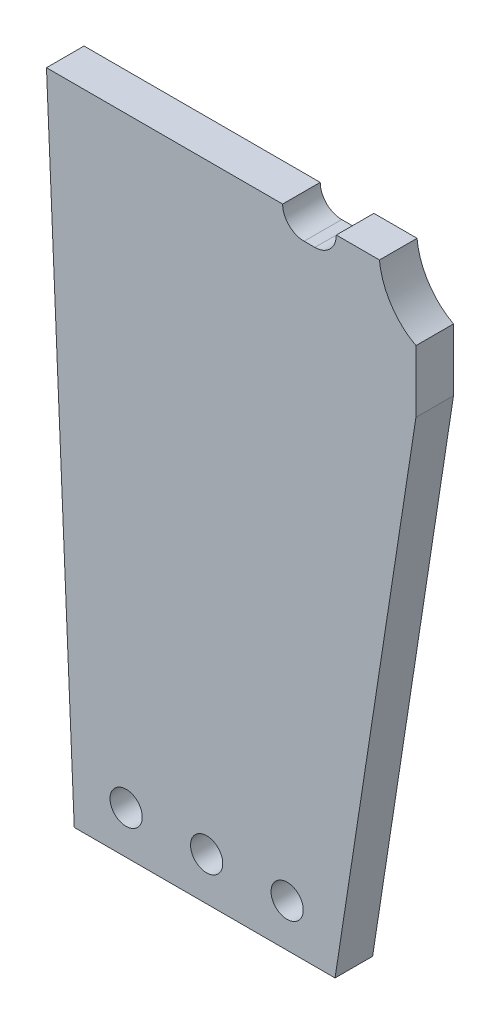
ISO-10303-21;
HEADER;
FILE_DESCRIPTION(('STEP AP214'),'2;1');
FILE_NAME('part.step','',(''),(''),'','','');
FILE_SCHEMA(('AUTOMOTIVE_DESIGN { 1 0 10303 214 1 1 1 1 }'));
ENDSEC;
DATA;
#1=APPLICATION_CONTEXT('core data for automotive mechanical design processes');
#2=APPLICATION_PROTOCOL_DEFINITION('international standard','automotive_design',2000,#1);
#3=PRODUCT_CONTEXT('',#1,'mechanical');
#4=PRODUCT('Part','Part','',(#3));
#5=PRODUCT_RELATED_PRODUCT_CATEGORY('part','',(#4));
#6=PRODUCT_DEFINITION_FORMATION('','',#4);
#7=PRODUCT_DEFINITION_CONTEXT('part definition',#1,'design');
#8=PRODUCT_DEFINITION('design','',#6,#7);
#9=PRODUCT_DEFINITION_SHAPE('','',#8);
#10=(LENGTH_UNIT() NAMED_UNIT(*) SI_UNIT(.MILLI.,.METRE.));
#11=(NAMED_UNIT(*) PLANE_ANGLE_UNIT() SI_UNIT($,.RADIAN.));
#12=(NAMED_UNIT(*) SI_UNIT($,.STERADIAN.) SOLID_ANGLE_UNIT());
#13=UNCERTAINTY_MEASURE_WITH_UNIT(LENGTH_MEASURE(1.E-05),#10,'distance_accuracy_value','');
#14=(GEOMETRIC_REPRESENTATION_CONTEXT(3) GLOBAL_UNCERTAINTY_ASSIGNED_CONTEXT((#13)) GLOBAL_UNIT_ASSIGNED_CONTEXT((#10,
#11,#12)) REPRESENTATION_CONTEXT('',''));
#15=CARTESIAN_POINT('',(0.,0.,0.));
#16=DIRECTION('',(0.,0.,1.));
#17=DIRECTION('',(1.,0.,0.));
#18=AXIS2_PLACEMENT_3D('',#15,#16,#17);
#19=CARTESIAN_POINT('',(46.8388847107798,0.,7.));
#20=DIRECTION('',(-1.,0.,0.));
#21=DIRECTION('',(0.,0.,1.));
#22=AXIS2_PLACEMENT_3D('',#19,#20,#21);
#23=PLANE('',#22);
#24=DIRECTION('',(0.,1.,0.));
#25=VECTOR('',#24,1.);
#26=CARTESIAN_POINT('',(46.8388847107798,0.,0.));
#27=LINE('',#26,#25);
#28=CARTESIAN_POINT('',(46.8388847107798,-72.0000000000028,0.));
#29=VERTEX_POINT('',#28);
#30=CARTESIAN_POINT('',(46.8388847107798,-60.421650597591,0.));
#31=VERTEX_POINT('',#30);
#32=EDGE_CURVE('E148',#29,#31,#27,.T.);
#33=ORIENTED_EDGE('',*,*,#32,.T.);
#34=DIRECTION('',(0.,0.,-1.));
#35=VECTOR('',#34,1.);
#36=CARTESIAN_POINT('',(46.8388847107798,-60.421650597591,7.));
#37=LINE('',#36,#35);
#38=CARTESIAN_POINT('',(46.8388847107798,-60.421650597591,7.));
#39=VERTEX_POINT('',#38);
#40=EDGE_CURVE('E42',#39,#31,#37,.T.);
#41=ORIENTED_EDGE('',*,*,#40,.F.);
#42=DIRECTION('',(0.,1.,0.));
#43=VECTOR('',#42,1.);
#44=CARTESIAN_POINT('',(46.8388847107798,0.,7.));
#45=LINE('',#44,#43);
#46=CARTESIAN_POINT('',(46.8388847107798,-72.0000000000028,7.));
#47=VERTEX_POINT('',#46);
#48=EDGE_CURVE('E175',#47,#39,#45,.T.);
#49=ORIENTED_EDGE('',*,*,#48,.F.);
#50=DIRECTION('',(0.,0.,-1.));
#51=VECTOR('',#50,1.);
#52=CARTESIAN_POINT('',(46.8388847107798,-72.0000000000028,7.));
#53=LINE('',#52,#51);
#54=EDGE_CURVE('E147',#47,#29,#53,.T.);
#55=ORIENTED_EDGE('',*,*,#54,.T.);
#56=EDGE_LOOP('',(#33,#41,#49,#55));
#57=FACE_BOUND('',#56,.T.);
#58=ADVANCED_FACE('F35',(#57),#23,.F.);
#59=CARTESIAN_POINT('',(46.8388847107809,-60.4216505962603,7.));
#60=CARTESIAN_POINT('',(42.9828321644224,-58.3958346056191,7.));
#61=CARTESIAN_POINT('',(38.906182162935,-51.8713110265102,7.));
#62=CARTESIAN_POINT('',(41.1386014831777,-41.6329969853445,7.));
#63=CARTESIAN_POINT('',(45.1889963757844,-37.4610602613759,7.));
#64=CARTESIAN_POINT('',(46.8388847133775,-34.5209470708188,7.));
#65=B_SPLINE_CURVE_WITH_KNOTS('',3,(#59,#60,#61,#62,#63,#64),.UNSPECIFIED.,.F.,.F.,(4,1,1,4),
(0.,0.43493140060886,0.661677592224686,0.998582109425411),.UNSPECIFIED.);
#66=DIRECTION('',(0.,0.,-1.));
#67=VECTOR('',#66,1.);
#68=SURFACE_OF_LINEAR_EXTRUSION('',#65,#67);
#69=CARTESIAN_POINT('',(46.8388847107809,-60.4216505962603,0.));
#70=CARTESIAN_POINT('',(42.9828321644224,-58.3958346056191,0.));
#71=CARTESIAN_POINT('',(38.906182162935,-51.8713110265102,0.));
#72=CARTESIAN_POINT('',(41.1386014831777,-41.6329969853445,0.));
#73=CARTESIAN_POINT('',(45.1889963757844,-37.4610602613759,0.));
#74=CARTESIAN_POINT('',(46.8388847133775,-34.5209470708188,0.));
#75=B_SPLINE_CURVE_WITH_KNOTS('',3,(#69,#70,#71,#72,#73,#74),.UNSPECIFIED.,.F.,.F.,(4,1,1,4),
(0.,0.43493140060886,0.661677592224686,0.998582109425411),.UNSPECIFIED.);
#76=CARTESIAN_POINT('',(40.0462321294866,-50.0000000000019,0.));
#77=VERTEX_POINT('',#76);
#78=EDGE_CURVE('E151',#31,#77,#75,.T.);
#79=ORIENTED_EDGE('',*,*,#78,.T.);
#80=DIRECTION('',(0.,0.,-1.));
#81=VECTOR('',#80,1.);
#82=CARTESIAN_POINT('',(40.0462321294866,-50.0000000000019,7.));
#83=LINE('',#82,#81);
#84=CARTESIAN_POINT('',(40.0462321294866,-50.0000000000019,7.));
#85=VERTEX_POINT('',#84);
#86=EDGE_CURVE('E183',#85,#77,#83,.T.);
#87=ORIENTED_EDGE('',*,*,#86,.F.);
#88=EDGE_CURVE('E100',#39,#85,#65,.T.);
#89=ORIENTED_EDGE('',*,*,#88,.F.);
#90=ORIENTED_EDGE('',*,*,#40,.T.);
#91=EDGE_LOOP('',(#79,#87,#89,#90));
#92=FACE_BOUND('',#91,.T.);
#93=ADVANCED_FACE('F185',(#92),#68,.F.);
#94=CARTESIAN_POINT('',(0.,-50.0000000000018,7.));
#95=DIRECTION('',(0.,1.,0.));
#96=DIRECTION('',(-1.,0.,0.));
#97=AXIS2_PLACEMENT_3D('',#94,#95,#96);
#98=PLANE('',#97);
#99=DIRECTION('',(1.,0.,0.));
#100=VECTOR('',#99,1.);
#101=CARTESIAN_POINT('',(0.,-50.0000000000018,0.));
#102=LINE('',#101,#100);
#103=CARTESIAN_POINT('',(32.,-50.0000000000019,0.));
#104=VERTEX_POINT('',#103);
#105=EDGE_CURVE('E156',#104,#77,#102,.T.);
#106=ORIENTED_EDGE('',*,*,#105,.F.);
#107=DIRECTION('',(0.,0.,-1.));
#108=VECTOR('',#107,1.);
#109=CARTESIAN_POINT('',(32.,-50.0000000000019,7.));
#110=LINE('',#109,#108);
#111=CARTESIAN_POINT('',(32.,-50.0000000000019,7.));
#112=VERTEX_POINT('',#111);
#113=EDGE_CURVE('E181',#112,#104,#110,.T.);
#114=ORIENTED_EDGE('',*,*,#113,.F.);
#115=DIRECTION('',(1.,0.,0.));
#116=VECTOR('',#115,1.);
#117=CARTESIAN_POINT('',(0.,-50.0000000000018,7.));
#118=LINE('',#117,#116);
#119=EDGE_CURVE('E198',#112,#85,#118,.T.);
#120=ORIENTED_EDGE('',*,*,#119,.T.);
#121=ORIENTED_EDGE('',*,*,#86,.T.);
#122=EDGE_LOOP('',(#106,#114,#120,#121));
#123=FACE_BOUND('',#122,.T.);
#124=ADVANCED_FACE('F195',(#123),#98,.T.);
#125=CARTESIAN_POINT('',(28.,-50.0000000000019,7.));
#126=DIRECTION('',(0.,0.,-1.));
#127=DIRECTION('',(-1.,0.,0.));
#128=AXIS2_PLACEMENT_3D('',#125,#126,#127);
#129=CYLINDRICAL_SURFACE('',#128,4.);
#130=CARTESIAN_POINT('',(28.,-50.0000000000019,0.));
#131=DIRECTION('',(0.,0.,1.));
#132=DIRECTION('',(1.,0.,0.));
#133=AXIS2_PLACEMENT_3D('',#130,#131,#132);
#134=CIRCLE('',#133,4.);
#135=CARTESIAN_POINT('',(28.,-54.0000000000019,0.));
#136=VERTEX_POINT('',#135);
#137=EDGE_CURVE('E162',#136,#104,#134,.T.);
#138=ORIENTED_EDGE('',*,*,#137,.F.);
#139=DIRECTION('',(0.,0.,-1.));
#140=VECTOR('',#139,1.);
#141=CARTESIAN_POINT('',(28.,-54.0000000000019,7.));
#142=LINE('',#141,#140);
#143=CARTESIAN_POINT('',(28.,-54.0000000000019,7.));
#144=VERTEX_POINT('',#143);
#145=EDGE_CURVE('E179',#144,#136,#142,.T.);
#146=ORIENTED_EDGE('',*,*,#145,.F.);
#147=CARTESIAN_POINT('',(28.,-50.0000000000019,7.));
#148=DIRECTION('',(0.,0.,1.));
#149=DIRECTION('',(1.,0.,0.));
#150=AXIS2_PLACEMENT_3D('',#147,#148,#149);
#151=CIRCLE('',#150,4.);
#152=EDGE_CURVE('E200',#144,#112,#151,.T.);
#153=ORIENTED_EDGE('',*,*,#152,.T.);
#154=ORIENTED_EDGE('',*,*,#113,.T.);
#155=EDGE_LOOP('',(#138,#146,#153,#154));
#156=FACE_BOUND('',#155,.T.);
#157=ADVANCED_FACE('F216',(#156),#129,.F.);
#158=CARTESIAN_POINT('',(0.,-54.0000000000019,7.));
#159=DIRECTION('',(0.,-1.,0.));
#160=DIRECTION('',(0.,0.,-1.));
#161=AXIS2_PLACEMENT_3D('',#158,#159,#160);
#162=PLANE('',#161);
#163=DIRECTION('',(-1.,0.,0.));
#164=VECTOR('',#163,1.);
#165=CARTESIAN_POINT('',(0.,-54.0000000000019,0.));
#166=LINE('',#165,#164);
#167=CARTESIAN_POINT('',(26.,-54.0000000000019,0.));
#168=VERTEX_POINT('',#167);
#169=EDGE_CURVE('E165',#136,#168,#166,.T.);
#170=ORIENTED_EDGE('',*,*,#169,.T.);
#171=DIRECTION('',(0.,0.,-1.));
#172=VECTOR('',#171,1.);
#173=CARTESIAN_POINT('',(26.,-54.0000000000019,7.));
#174=LINE('',#173,#172);
#175=CARTESIAN_POINT('',(26.,-54.0000000000019,7.));
#176=VERTEX_POINT('',#175);
#177=EDGE_CURVE('E127',#176,#168,#174,.T.);
#178=ORIENTED_EDGE('',*,*,#177,.F.);
#179=DIRECTION('',(-1.,0.,0.));
#180=VECTOR('',#179,1.);
#181=CARTESIAN_POINT('',(0.,-54.0000000000019,7.));
#182=LINE('',#181,#180);
#183=EDGE_CURVE('E136',#144,#176,#182,.T.);
#184=ORIENTED_EDGE('',*,*,#183,.F.);
#185=ORIENTED_EDGE('',*,*,#145,.T.);
#186=EDGE_LOOP('',(#170,#178,#184,#185));
#187=FACE_BOUND('',#186,.T.);
#188=ADVANCED_FACE('F219',(#187),#162,.F.);
#189=CARTESIAN_POINT('',(26.,-50.0000000000019,7.));
#190=DIRECTION('',(0.,0.,-1.));
#191=DIRECTION('',(-1.,0.,0.));
#192=AXIS2_PLACEMENT_3D('',#189,#190,#191);
#193=CYLINDRICAL_SURFACE('',#192,4.);
#194=CARTESIAN_POINT('',(26.,-50.0000000000019,0.));
#195=DIRECTION('',(0.,0.,1.));
#196=DIRECTION('',(1.,0.,0.));
#197=AXIS2_PLACEMENT_3D('',#194,#195,#196);
#198=CIRCLE('',#197,4.);
#199=CARTESIAN_POINT('',(22.,-50.0000000000019,0.));
#200=VERTEX_POINT('',#199);
#201=EDGE_CURVE('E122',#200,#168,#198,.T.);
#202=ORIENTED_EDGE('',*,*,#201,.F.);
#203=DIRECTION('',(0.,0.,-1.));
#204=VECTOR('',#203,1.);
#205=CARTESIAN_POINT('',(22.,-50.0000000000019,7.));
#206=LINE('',#205,#204);
#207=CARTESIAN_POINT('',(22.,-50.0000000000019,7.));
#208=VERTEX_POINT('',#207);
#209=EDGE_CURVE('E117',#208,#200,#206,.T.);
#210=ORIENTED_EDGE('',*,*,#209,.F.);
#211=CARTESIAN_POINT('',(26.,-50.0000000000019,7.));
#212=DIRECTION('',(0.,0.,1.));
#213=DIRECTION('',(1.,0.,0.));
#214=AXIS2_PLACEMENT_3D('',#211,#212,#213);
#215=CIRCLE('',#214,4.);
#216=EDGE_CURVE('E120',#208,#176,#215,.T.);
#217=ORIENTED_EDGE('',*,*,#216,.T.);
#218=ORIENTED_EDGE('',*,*,#177,.T.);
#219=EDGE_LOOP('',(#202,#210,#217,#218));
#220=FACE_BOUND('',#219,.T.);
#221=ADVANCED_FACE('F119',(#220),#193,.F.);
#222=CARTESIAN_POINT('',(0.,-50.0000000000019,7.));
#223=DIRECTION('',(0.,1.,0.));
#224=DIRECTION('',(0.,0.,1.));
#225=AXIS2_PLACEMENT_3D('',#222,#223,#224);
#226=PLANE('',#225);
#227=DIRECTION('',(1.,0.,0.));
#228=VECTOR('',#227,1.);
#229=CARTESIAN_POINT('',(0.,-50.0000000000019,0.));
#230=LINE('',#229,#228);
#231=CARTESIAN_POINT('',(-22.,-50.0000000000019,0.));
#232=VERTEX_POINT('',#231);
#233=EDGE_CURVE('E169',#232,#200,#230,.T.);
#234=ORIENTED_EDGE('',*,*,#233,.F.);
#235=DIRECTION('',(0.,0.,-1.));
#236=VECTOR('',#235,1.);
#237=CARTESIAN_POINT('',(-22.,-50.0000000000019,7.));
#238=LINE('',#237,#236);
#239=CARTESIAN_POINT('',(-22.,-50.0000000000019,7.));
#240=VERTEX_POINT('',#239);
#241=EDGE_CURVE('E128',#240,#232,#238,.T.);
#242=ORIENTED_EDGE('',*,*,#241,.F.);
#243=DIRECTION('',(1.,0.,0.));
#244=VECTOR('',#243,1.);
#245=CARTESIAN_POINT('',(0.,-50.0000000000019,7.));
#246=LINE('',#245,#244);
#247=EDGE_CURVE('E133',#240,#208,#246,.T.);
#248=ORIENTED_EDGE('',*,*,#247,.T.);
#249=ORIENTED_EDGE('',*,*,#209,.T.);
#250=EDGE_LOOP('',(#234,#242,#248,#249));
#251=FACE_BOUND('',#250,.T.);
#252=ADVANCED_FACE('F139',(#251),#226,.T.);
#253=CARTESIAN_POINT('',(-24.111994596752,-1.0401252571148,7.));
#254=DIRECTION('',(0.999070885107477,0.043097175436009,0.));
#255=DIRECTION('',(-0.043097175436009,0.999070885107477,0.));
#256=AXIS2_PLACEMENT_3D('',#253,#254,#255);
#257=PLANE('',#256);
#258=DIRECTION('',(0.043097175436009,-0.999070885107477,0.));
#259=VECTOR('',#258,1.);
#260=CARTESIAN_POINT('',(-24.111994596752,-1.0401252571148,0.));
#261=LINE('',#260,#259);
#262=CARTESIAN_POINT('',(-16.8235294117647,-170.000000000002,0.));
#263=VERTEX_POINT('',#262);
#264=EDGE_CURVE('E171',#232,#263,#261,.T.);
#265=ORIENTED_EDGE('',*,*,#264,.T.);
#266=DIRECTION('',(0.,0.,1.));
#267=VECTOR('',#266,1.);
#268=CARTESIAN_POINT('',(-16.8235294117647,-170.000000000002,7.));
#269=LINE('',#268,#267);
#270=CARTESIAN_POINT('',(-16.8235294117647,-170.000000000002,7.));
#271=VERTEX_POINT('',#270);
#272=EDGE_CURVE('E49',#263,#271,#269,.T.);
#273=ORIENTED_EDGE('',*,*,#272,.T.);
#274=DIRECTION('',(0.043097175436009,-0.999070885107477,0.));
#275=VECTOR('',#274,1.);
#276=CARTESIAN_POINT('',(-24.111994596752,-1.0401252571148,7.));
#277=LINE('',#276,#275);
#278=EDGE_CURVE('E141',#240,#271,#277,.T.);
#279=ORIENTED_EDGE('',*,*,#278,.F.);
#280=ORIENTED_EDGE('',*,*,#241,.T.);
#281=EDGE_LOOP('',(#265,#273,#279,#280));
#282=FACE_BOUND('',#281,.T.);
#283=ADVANCED_FACE('F228',(#282),#257,.F.);
#284=CARTESIAN_POINT('',(56.5750501212423,-8.70208883605923,7.));
#285=DIRECTION('',(-0.988376331409149,0.152027061769254,0.));
#286=DIRECTION('',(-0.152027061769254,-0.988376331409149,0.));
#287=AXIS2_PLACEMENT_3D('',#284,#285,#286);
#288=PLANE('',#287);
#289=DIRECTION('',(0.152027061769254,0.988376331409149,0.));
#290=VECTOR('',#289,1.);
#291=CARTESIAN_POINT('',(56.5750501212423,-8.70208883605923,7.));
#292=LINE('',#291,#290);
#293=CARTESIAN_POINT('',(31.7650190384348,-170.000000000002,7.));
#294=VERTEX_POINT('',#293);
#295=EDGE_CURVE('E57',#294,#47,#292,.T.);
#296=ORIENTED_EDGE('',*,*,#295,.F.);
#297=DIRECTION('',(0.,0.,-1.));
#298=VECTOR('',#297,1.);
#299=CARTESIAN_POINT('',(31.7650190384348,-170.000000000002,7.));
#300=LINE('',#299,#298);
#301=CARTESIAN_POINT('',(31.7650190384348,-170.000000000002,0.));
#302=VERTEX_POINT('',#301);
#303=EDGE_CURVE('E370',#294,#302,#300,.T.);
#304=ORIENTED_EDGE('',*,*,#303,.T.);
#305=DIRECTION('',(0.152027061769254,0.988376331409149,0.));
#306=VECTOR('',#305,1.);
#307=CARTESIAN_POINT('',(56.5750501212423,-8.70208883605923,0.));
#308=LINE('',#307,#306);
#309=EDGE_CURVE('E91',#302,#29,#308,.T.);
#310=ORIENTED_EDGE('',*,*,#309,.T.);
#311=ORIENTED_EDGE('',*,*,#54,.F.);
#312=EDGE_LOOP('',(#296,#304,#310,#311));
#313=FACE_BOUND('',#312,.T.);
#314=ADVANCED_FACE('F231',(#313),#288,.F.);
#315=CARTESIAN_POINT('',(0.,0.,7.));
#316=DIRECTION('',(0.,0.,1.));
#317=DIRECTION('',(1.,0.,0.));
#318=AXIS2_PLACEMENT_3D('',#315,#316,#317);
#319=PLANE('',#318);
#320=CARTESIAN_POINT('',(-7.15932766148222,-162.000000000002,7.));
#321=DIRECTION('',(0.,0.,1.));
#322=DIRECTION('',(1.,0.,0.));
#323=AXIS2_PLACEMENT_3D('',#320,#321,#322);
#324=CIRCLE('',#323,3.);
#325=CARTESIAN_POINT('',(-4.15932766148222,-162.000000000002,7.));
#326=VERTEX_POINT('',#325);
#327=EDGE_CURVE('E352',#326,#326,#324,.T.);
#328=ORIENTED_EDGE('',*,*,#327,.F.);
#329=EDGE_LOOP('',(#328));
#330=FACE_BOUND('',#329,.T.);
#331=CARTESIAN_POINT('',(7.84067233851778,-162.000000000002,7.));
#332=DIRECTION('',(0.,0.,1.));
#333=DIRECTION('',(1.,0.,0.));
#334=AXIS2_PLACEMENT_3D('',#331,#332,#333);
#335=CIRCLE('',#334,3.);
#336=CARTESIAN_POINT('',(10.8406723385178,-162.000000000002,7.));
#337=VERTEX_POINT('',#336);
#338=EDGE_CURVE('E358',#337,#337,#335,.T.);
#339=ORIENTED_EDGE('',*,*,#338,.F.);
#340=EDGE_LOOP('',(#339));
#341=FACE_BOUND('',#340,.T.);
#342=CARTESIAN_POINT('',(22.8406723385178,-162.000000000002,7.));
#343=DIRECTION('',(0.,0.,1.));
#344=DIRECTION('',(1.,0.,0.));
#345=AXIS2_PLACEMENT_3D('',#342,#343,#344);
#346=CIRCLE('',#345,3.);
#347=CARTESIAN_POINT('',(25.8406723385178,-162.000000000002,7.));
#348=VERTEX_POINT('',#347);
#349=EDGE_CURVE('E366',#348,#348,#346,.T.);
#350=ORIENTED_EDGE('',*,*,#349,.F.);
#351=EDGE_LOOP('',(#350));
#352=FACE_BOUND('',#351,.T.);
#353=DIRECTION('',(-1.,0.,0.));
#354=VECTOR('',#353,1.);
#355=CARTESIAN_POINT('',(-156.476204432479,-170.000000000002,7.));
#356=LINE('',#355,#354);
#357=EDGE_CURVE('E355',#294,#271,#356,.T.);
#358=ORIENTED_EDGE('',*,*,#357,.F.);
#359=ORIENTED_EDGE('',*,*,#295,.T.);
#360=ORIENTED_EDGE('',*,*,#48,.T.);
#361=ORIENTED_EDGE('',*,*,#88,.T.);
#362=ORIENTED_EDGE('',*,*,#119,.F.);
#363=ORIENTED_EDGE('',*,*,#152,.F.);
#364=ORIENTED_EDGE('',*,*,#183,.T.);
#365=ORIENTED_EDGE('',*,*,#216,.F.);
#366=ORIENTED_EDGE('',*,*,#247,.F.);
#367=ORIENTED_EDGE('',*,*,#278,.T.);
#368=EDGE_LOOP('',(#358,#359,#360,#361,#362,#363,#364,#365,#366,#367));
#369=FACE_BOUND('',#368,.T.);
#370=ADVANCED_FACE('F131',(#330,#341,#352,#369),#319,.T.);
#371=CARTESIAN_POINT('',(0.,0.,0.));
#372=DIRECTION('',(0.,0.,1.));
#373=DIRECTION('',(1.,0.,0.));
#374=AXIS2_PLACEMENT_3D('',#371,#372,#373);
#375=PLANE('',#374);
#376=CARTESIAN_POINT('',(-7.15932766148222,-162.000000000002,0.));
#377=DIRECTION('',(0.,0.,1.));
#378=DIRECTION('',(1.,0.,0.));
#379=AXIS2_PLACEMENT_3D('',#376,#377,#378);
#380=CIRCLE('',#379,3.);
#381=CARTESIAN_POINT('',(-4.15932766148222,-162.000000000002,0.));
#382=VERTEX_POINT('',#381);
#383=EDGE_CURVE('E349',#382,#382,#380,.T.);
#384=ORIENTED_EDGE('',*,*,#383,.T.);
#385=EDGE_LOOP('',(#384));
#386=FACE_BOUND('',#385,.T.);
#387=CARTESIAN_POINT('',(7.84067233851778,-162.000000000002,0.));
#388=DIRECTION('',(0.,0.,1.));
#389=DIRECTION('',(1.,0.,0.));
#390=AXIS2_PLACEMENT_3D('',#387,#388,#389);
#391=CIRCLE('',#390,3.);
#392=CARTESIAN_POINT('',(10.8406723385178,-162.000000000002,0.));
#393=VERTEX_POINT('',#392);
#394=EDGE_CURVE('E353',#393,#393,#391,.T.);
#395=ORIENTED_EDGE('',*,*,#394,.T.);
#396=EDGE_LOOP('',(#395));
#397=FACE_BOUND('',#396,.T.);
#398=CARTESIAN_POINT('',(22.8406723385178,-162.000000000002,0.));
#399=DIRECTION('',(0.,0.,1.));
#400=DIRECTION('',(1.,0.,0.));
#401=AXIS2_PLACEMENT_3D('',#398,#399,#400);
#402=CIRCLE('',#401,3.);
#403=CARTESIAN_POINT('',(25.8406723385178,-162.000000000002,0.));
#404=VERTEX_POINT('',#403);
#405=EDGE_CURVE('E363',#404,#404,#402,.T.);
#406=ORIENTED_EDGE('',*,*,#405,.T.);
#407=EDGE_LOOP('',(#406));
#408=FACE_BOUND('',#407,.T.);
#409=ORIENTED_EDGE('',*,*,#309,.F.);
#410=DIRECTION('',(-1.,0.,0.));
#411=VECTOR('',#410,1.);
#412=CARTESIAN_POINT('',(0.,-170.000000000002,0.));
#413=LINE('',#412,#411);
#414=EDGE_CURVE('E11',#302,#263,#413,.T.);
#415=ORIENTED_EDGE('',*,*,#414,.T.);
#416=ORIENTED_EDGE('',*,*,#264,.F.);
#417=ORIENTED_EDGE('',*,*,#233,.T.);
#418=ORIENTED_EDGE('',*,*,#201,.T.);
#419=ORIENTED_EDGE('',*,*,#169,.F.);
#420=ORIENTED_EDGE('',*,*,#137,.T.);
#421=ORIENTED_EDGE('',*,*,#105,.T.);
#422=ORIENTED_EDGE('',*,*,#78,.F.);
#423=ORIENTED_EDGE('',*,*,#32,.F.);
#424=EDGE_LOOP('',(#409,#415,#416,#417,#418,#419,#420,#421,#422,#423));
#425=FACE_BOUND('',#424,.T.);
#426=ADVANCED_FACE('F190',(#386,#397,#408,#425),#375,.F.);
#427=CARTESIAN_POINT('',(-156.476204432479,-170.000000000002,-23.));
#428=DIRECTION('',(0.,1.,0.));
#429=DIRECTION('',(0.,0.,1.));
#430=AXIS2_PLACEMENT_3D('',#427,#428,#429);
#431=PLANE('',#430);
#432=ORIENTED_EDGE('',*,*,#414,.F.);
#433=ORIENTED_EDGE('',*,*,#303,.F.);
#434=ORIENTED_EDGE('',*,*,#357,.T.);
#435=ORIENTED_EDGE('',*,*,#272,.F.);
#436=EDGE_LOOP('',(#432,#433,#434,#435));
#437=FACE_BOUND('',#436,.T.);
#438=ADVANCED_FACE('F237',(#437),#431,.F.);
#439=CARTESIAN_POINT('',(22.8406723385178,-162.000000000002,0.));
#440=DIRECTION('',(0.,0.,1.));
#441=DIRECTION('',(1.,0.,0.));
#442=AXIS2_PLACEMENT_3D('',#439,#440,#441);
#443=CYLINDRICAL_SURFACE('',#442,3.);
#444=ORIENTED_EDGE('',*,*,#405,.F.);
#445=EDGE_LOOP('',(#444));
#446=FACE_BOUND('',#445,.T.);
#447=ORIENTED_EDGE('',*,*,#349,.T.);
#448=EDGE_LOOP('',(#447));
#449=FACE_BOUND('',#448,.T.);
#450=ADVANCED_FACE('F244',(#446,#449),#443,.F.);
#451=CARTESIAN_POINT('',(7.84067233851778,-162.000000000002,0.));
#452=DIRECTION('',(0.,0.,1.));
#453=DIRECTION('',(1.,0.,0.));
#454=AXIS2_PLACEMENT_3D('',#451,#452,#453);
#455=CYLINDRICAL_SURFACE('',#454,3.);
#456=ORIENTED_EDGE('',*,*,#394,.F.);
#457=EDGE_LOOP('',(#456));
#458=FACE_BOUND('',#457,.T.);
#459=ORIENTED_EDGE('',*,*,#338,.T.);
#460=EDGE_LOOP('',(#459));
#461=FACE_BOUND('',#460,.T.);
#462=ADVANCED_FACE('F247',(#458,#461),#455,.F.);
#463=CARTESIAN_POINT('',(-7.15932766148222,-162.000000000002,0.));
#464=DIRECTION('',(0.,0.,1.));
#465=DIRECTION('',(1.,0.,0.));
#466=AXIS2_PLACEMENT_3D('',#463,#464,#465);
#467=CYLINDRICAL_SURFACE('',#466,3.);
#468=ORIENTED_EDGE('',*,*,#383,.F.);
#469=EDGE_LOOP('',(#468));
#470=FACE_BOUND('',#469,.T.);
#471=ORIENTED_EDGE('',*,*,#327,.T.);
#472=EDGE_LOOP('',(#471));
#473=FACE_BOUND('',#472,.T.);
#474=ADVANCED_FACE('F251',(#470,#473),#467,.F.);
#475=CLOSED_SHELL('',(#58,#93,#124,#157,#188,#221,#252,#283,#314,#370,#426,#438,#450,#462,#474));
#476=MANIFOLD_SOLID_BREP('B2',#475);
#477=ADVANCED_BREP_SHAPE_REPRESENTATION('',(#18,#476),#14);
#478=SHAPE_DEFINITION_REPRESENTATION(#9,#477);
ENDSEC;
END-ISO-10303-21;
